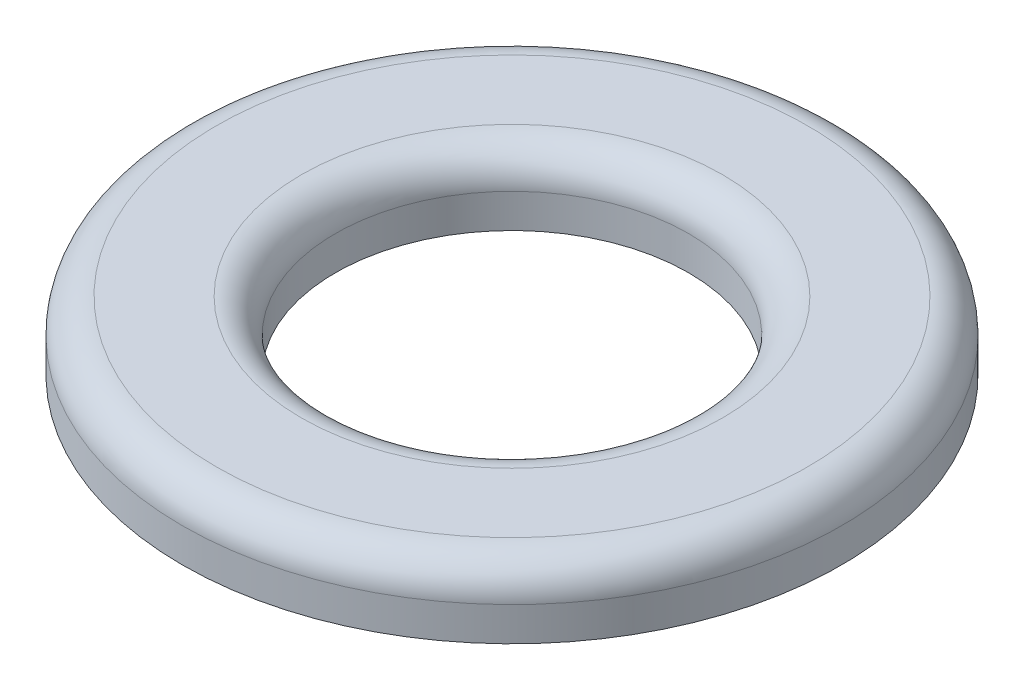
ISO-10303-21;
HEADER;
FILE_DESCRIPTION(('STEP AP214'),'2;1');
FILE_NAME('part.step','',(''),(''),'','','');
FILE_SCHEMA(('AUTOMOTIVE_DESIGN { 1 0 10303 214 1 1 1 1 }'));
ENDSEC;
DATA;
#1=APPLICATION_CONTEXT('core data for automotive mechanical design processes');
#2=APPLICATION_PROTOCOL_DEFINITION('international standard','automotive_design',2000,#1);
#3=PRODUCT_CONTEXT('',#1,'mechanical');
#4=PRODUCT('Part','Part','',(#3));
#5=PRODUCT_RELATED_PRODUCT_CATEGORY('part','',(#4));
#6=PRODUCT_DEFINITION_FORMATION('','',#4);
#7=PRODUCT_DEFINITION_CONTEXT('part definition',#1,'design');
#8=PRODUCT_DEFINITION('design','',#6,#7);
#9=PRODUCT_DEFINITION_SHAPE('','',#8);
#10=(LENGTH_UNIT() NAMED_UNIT(*) SI_UNIT(.MILLI.,.METRE.));
#11=(NAMED_UNIT(*) PLANE_ANGLE_UNIT() SI_UNIT($,.RADIAN.));
#12=(NAMED_UNIT(*) SI_UNIT($,.STERADIAN.) SOLID_ANGLE_UNIT());
#13=UNCERTAINTY_MEASURE_WITH_UNIT(LENGTH_MEASURE(1.E-05),#10,'distance_accuracy_value','');
#14=(GEOMETRIC_REPRESENTATION_CONTEXT(3) GLOBAL_UNCERTAINTY_ASSIGNED_CONTEXT((#13)) GLOBAL_UNIT_ASSIGNED_CONTEXT((#10,
#11,#12)) REPRESENTATION_CONTEXT('',''));
#15=CARTESIAN_POINT('',(0.,0.,0.));
#16=DIRECTION('',(0.,0.,1.));
#17=DIRECTION('',(1.,0.,0.));
#18=AXIS2_PLACEMENT_3D('',#15,#16,#17);
#19=CARTESIAN_POINT('',(0.,1.,0.));
#20=DIRECTION('',(0.,1.,0.));
#21=DIRECTION('',(0.,0.,1.));
#22=AXIS2_PLACEMENT_3D('',#19,#20,#21);
#23=PLANE('',#22);
#24=CARTESIAN_POINT('',(0.,1.,0.));
#25=DIRECTION('',(0.,1.,0.));
#26=DIRECTION('',(0.,0.,1.));
#27=AXIS2_PLACEMENT_3D('',#24,#25,#26);
#28=CIRCLE('',#27,3.1);
#29=CARTESIAN_POINT('',(0.,1.,3.1));
#30=VERTEX_POINT('',#29);
#31=EDGE_CURVE('E44',#30,#30,#28,.F.);
#32=ORIENTED_EDGE('',*,*,#31,.T.);
#33=EDGE_LOOP('',(#32));
#34=FACE_BOUND('',#33,.T.);
#35=CARTESIAN_POINT('',(0.,1.,0.));
#36=DIRECTION('',(0.,1.,0.));
#37=DIRECTION('',(0.,0.,1.));
#38=AXIS2_PLACEMENT_3D('',#35,#36,#37);
#39=CIRCLE('',#38,4.35);
#40=CARTESIAN_POINT('',(0.,1.,4.35));
#41=VERTEX_POINT('',#40);
#42=EDGE_CURVE('E49',#41,#41,#39,.T.);
#43=ORIENTED_EDGE('',*,*,#42,.T.);
#44=EDGE_LOOP('',(#43));
#45=FACE_BOUND('',#44,.T.);
#46=ADVANCED_FACE('F36',(#34,#45),#23,.T.);
#47=CARTESIAN_POINT('',(0.,0.,0.));
#48=DIRECTION('',(0.,1.,0.));
#49=DIRECTION('',(0.,0.,1.));
#50=AXIS2_PLACEMENT_3D('',#47,#48,#49);
#51=PLANE('',#50);
#52=CARTESIAN_POINT('',(0.,0.,0.));
#53=DIRECTION('',(0.,1.,0.));
#54=DIRECTION('',(0.,0.,1.));
#55=AXIS2_PLACEMENT_3D('',#52,#53,#54);
#56=CIRCLE('',#55,4.85);
#57=CARTESIAN_POINT('',(0.,0.,4.85));
#58=VERTEX_POINT('',#57);
#59=EDGE_CURVE('E60',#58,#58,#56,.T.);
#60=ORIENTED_EDGE('',*,*,#59,.F.);
#61=EDGE_LOOP('',(#60));
#62=FACE_BOUND('',#61,.T.);
#63=CARTESIAN_POINT('',(0.,0.,0.));
#64=DIRECTION('',(0.,1.,0.));
#65=DIRECTION('',(0.,0.,1.));
#66=AXIS2_PLACEMENT_3D('',#63,#64,#65);
#67=CIRCLE('',#66,2.6);
#68=CARTESIAN_POINT('',(0.,0.,2.6));
#69=VERTEX_POINT('',#68);
#70=EDGE_CURVE('E64',#69,#69,#67,.T.);
#71=ORIENTED_EDGE('',*,*,#70,.T.);
#72=EDGE_LOOP('',(#71));
#73=FACE_BOUND('',#72,.T.);
#74=ADVANCED_FACE('F69',(#62,#73),#51,.F.);
#75=CARTESIAN_POINT('',(0.,1.,0.));
#76=DIRECTION('',(0.,-1.,0.));
#77=DIRECTION('',(0.,0.,-1.));
#78=AXIS2_PLACEMENT_3D('',#75,#76,#77);
#79=CYLINDRICAL_SURFACE('',#78,4.85);
#80=CARTESIAN_POINT('',(0.,0.5,0.));
#81=DIRECTION('',(0.,1.,0.));
#82=DIRECTION('',(0.,0.,1.));
#83=AXIS2_PLACEMENT_3D('',#80,#81,#82);
#84=CIRCLE('',#83,4.85);
#85=CARTESIAN_POINT('',(0.,0.5,4.85));
#86=VERTEX_POINT('',#85);
#87=EDGE_CURVE('E10',#86,#86,#84,.F.);
#88=ORIENTED_EDGE('',*,*,#87,.T.);
#89=EDGE_LOOP('',(#88));
#90=FACE_BOUND('',#89,.T.);
#91=ORIENTED_EDGE('',*,*,#59,.T.);
#92=EDGE_LOOP('',(#91));
#93=FACE_BOUND('',#92,.T.);
#94=ADVANCED_FACE('F74',(#90,#93),#79,.T.);
#95=CARTESIAN_POINT('',(0.,1.,0.));
#96=DIRECTION('',(0.,-1.,0.));
#97=DIRECTION('',(0.,0.,-1.));
#98=AXIS2_PLACEMENT_3D('',#95,#96,#97);
#99=CYLINDRICAL_SURFACE('',#98,2.6);
#100=CARTESIAN_POINT('',(0.,0.5,0.));
#101=DIRECTION('',(0.,1.,0.));
#102=DIRECTION('',(0.,0.,1.));
#103=AXIS2_PLACEMENT_3D('',#100,#101,#102);
#104=CIRCLE('',#103,2.6);
#105=CARTESIAN_POINT('',(0.,0.5,2.6));
#106=VERTEX_POINT('',#105);
#107=EDGE_CURVE('E54',#106,#106,#104,.T.);
#108=ORIENTED_EDGE('',*,*,#107,.T.);
#109=EDGE_LOOP('',(#108));
#110=FACE_BOUND('',#109,.T.);
#111=ORIENTED_EDGE('',*,*,#70,.F.);
#112=EDGE_LOOP('',(#111));
#113=FACE_BOUND('',#112,.T.);
#114=ADVANCED_FACE('F71',(#110,#113),#99,.F.);
#115=CARTESIAN_POINT('',(0.,0.5,0.));
#116=DIRECTION('',(0.,1.,0.));
#117=DIRECTION('',(0.,0.,1.));
#118=AXIS2_PLACEMENT_3D('',#115,#116,#117);
#119=TOROIDAL_SURFACE('',#118,3.1,0.5);
#120=ORIENTED_EDGE('',*,*,#31,.F.);
#121=EDGE_LOOP('',(#120));
#122=FACE_BOUND('',#121,.T.);
#123=ORIENTED_EDGE('',*,*,#107,.F.);
#124=EDGE_LOOP('',(#123));
#125=FACE_BOUND('',#124,.T.);
#126=ADVANCED_FACE('F73',(#122,#125),#119,.T.);
#127=CARTESIAN_POINT('',(0.,0.5,0.));
#128=DIRECTION('',(0.,1.,0.));
#129=DIRECTION('',(0.,0.,1.));
#130=AXIS2_PLACEMENT_3D('',#127,#128,#129);
#131=TOROIDAL_SURFACE('',#130,4.35,0.5);
#132=ORIENTED_EDGE('',*,*,#87,.F.);
#133=EDGE_LOOP('',(#132));
#134=FACE_BOUND('',#133,.T.);
#135=ORIENTED_EDGE('',*,*,#42,.F.);
#136=EDGE_LOOP('',(#135));
#137=FACE_BOUND('',#136,.T.);
#138=ADVANCED_FACE('F38',(#134,#137),#131,.T.);
#139=CLOSED_SHELL('',(#46,#74,#94,#114,#126,#138));
#140=MANIFOLD_SOLID_BREP('B2',#139);
#141=ADVANCED_BREP_SHAPE_REPRESENTATION('',(#18,#140),#14);
#142=SHAPE_DEFINITION_REPRESENTATION(#9,#141);
ENDSEC;
END-ISO-10303-21;
